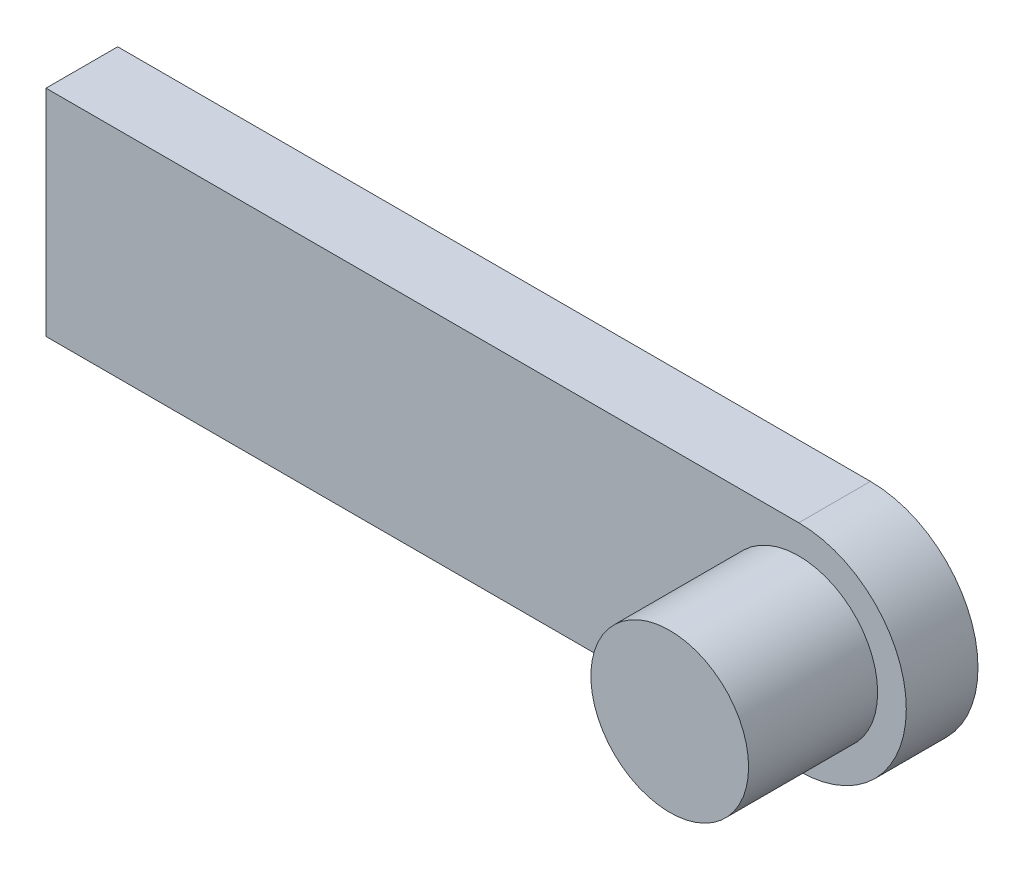
ISO-10303-21;
HEADER;
FILE_DESCRIPTION(('STEP AP214'),'2;1');
FILE_NAME('part.step','',(''),(''),'','','');
FILE_SCHEMA(('AUTOMOTIVE_DESIGN { 1 0 10303 214 1 1 1 1 }'));
ENDSEC;
DATA;
#1=APPLICATION_CONTEXT('core data for automotive mechanical design processes');
#2=APPLICATION_PROTOCOL_DEFINITION('international standard','automotive_design',2000,#1);
#3=PRODUCT_CONTEXT('',#1,'mechanical');
#4=PRODUCT('Part','Part','',(#3));
#5=PRODUCT_RELATED_PRODUCT_CATEGORY('part','',(#4));
#6=PRODUCT_DEFINITION_FORMATION('','',#4);
#7=PRODUCT_DEFINITION_CONTEXT('part definition',#1,'design');
#8=PRODUCT_DEFINITION('design','',#6,#7);
#9=PRODUCT_DEFINITION_SHAPE('','',#8);
#10=(LENGTH_UNIT() NAMED_UNIT(*) SI_UNIT(.MILLI.,.METRE.));
#11=(NAMED_UNIT(*) PLANE_ANGLE_UNIT() SI_UNIT($,.RADIAN.));
#12=(NAMED_UNIT(*) SI_UNIT($,.STERADIAN.) SOLID_ANGLE_UNIT());
#13=UNCERTAINTY_MEASURE_WITH_UNIT(LENGTH_MEASURE(1.E-05),#10,'distance_accuracy_value','');
#14=(GEOMETRIC_REPRESENTATION_CONTEXT(3) GLOBAL_UNCERTAINTY_ASSIGNED_CONTEXT((#13)) GLOBAL_UNIT_ASSIGNED_CONTEXT((#10,
#11,#12)) REPRESENTATION_CONTEXT('',''));
#15=CARTESIAN_POINT('',(0.,0.,0.));
#16=DIRECTION('',(0.,0.,1.));
#17=DIRECTION('',(1.,0.,0.));
#18=AXIS2_PLACEMENT_3D('',#15,#16,#17);
#19=CARTESIAN_POINT('',(0.,0.,0.25));
#20=DIRECTION('',(0.,0.,1.));
#21=DIRECTION('',(0.707106781186548,0.707106781186548,0.));
#22=AXIS2_PLACEMENT_3D('',#19,#20,#21);
#23=PLANE('',#22);
#24=DIRECTION('',(-1.,0.,0.));
#25=VECTOR('',#24,1.);
#26=CARTESIAN_POINT('',(1.275,0.375,0.25));
#27=LINE('',#26,#25);
#28=CARTESIAN_POINT('',(1.275,0.375,0.25));
#29=VERTEX_POINT('',#28);
#30=CARTESIAN_POINT('',(-1.35,0.375,0.25));
#31=VERTEX_POINT('',#30);
#32=EDGE_CURVE('E11',#29,#31,#27,.T.);
#33=ORIENTED_EDGE('',*,*,#32,.T.);
#34=DIRECTION('',(0.,-1.,0.));
#35=VECTOR('',#34,1.);
#36=CARTESIAN_POINT('',(-1.35,0.375,0.25));
#37=LINE('',#36,#35);
#38=CARTESIAN_POINT('',(-1.35,-0.375,0.25));
#39=VERTEX_POINT('',#38);
#40=EDGE_CURVE('E26',#31,#39,#37,.T.);
#41=ORIENTED_EDGE('',*,*,#40,.T.);
#42=DIRECTION('',(1.,0.,0.));
#43=VECTOR('',#42,1.);
#44=CARTESIAN_POINT('',(-1.35,-0.375,0.25));
#45=LINE('',#44,#43);
#46=CARTESIAN_POINT('',(1.275,-0.375,0.25));
#47=VERTEX_POINT('',#46);
#48=EDGE_CURVE('E100',#39,#47,#45,.T.);
#49=ORIENTED_EDGE('',*,*,#48,.T.);
#50=CARTESIAN_POINT('',(1.275,0.,0.25));
#51=DIRECTION('',(0.,0.,1.));
#52=DIRECTION('',(0.,-1.,0.));
#53=AXIS2_PLACEMENT_3D('',#50,#51,#52);
#54=CIRCLE('',#53,0.375);
#55=EDGE_CURVE('E68',#47,#29,#54,.T.);
#56=ORIENTED_EDGE('',*,*,#55,.T.);
#57=EDGE_LOOP('',(#33,#41,#49,#56));
#58=FACE_BOUND('',#57,.T.);
#59=CARTESIAN_POINT('',(1.275,0.,0.25));
#60=DIRECTION('',(0.,0.,1.));
#61=DIRECTION('',(1.,0.,0.));
#62=AXIS2_PLACEMENT_3D('',#59,#60,#61);
#63=CIRCLE('',#62,0.275);
#64=CARTESIAN_POINT('',(1.55,0.,0.25));
#65=VERTEX_POINT('',#64);
#66=EDGE_CURVE('E95',#65,#65,#63,.T.);
#67=ORIENTED_EDGE('',*,*,#66,.F.);
#68=EDGE_LOOP('',(#67));
#69=FACE_BOUND('',#68,.T.);
#70=ADVANCED_FACE('F16',(#58,#69),#23,.T.);
#71=CARTESIAN_POINT('',(1.275,0.,0.25));
#72=DIRECTION('',(0.,0.,1.));
#73=DIRECTION('',(1.,0.,0.));
#74=AXIS2_PLACEMENT_3D('',#71,#72,#73);
#75=CYLINDRICAL_SURFACE('',#74,0.275);
#76=CARTESIAN_POINT('',(1.275,0.,0.7));
#77=DIRECTION('',(0.,0.,1.));
#78=DIRECTION('',(1.,0.,0.));
#79=AXIS2_PLACEMENT_3D('',#76,#77,#78);
#80=CIRCLE('',#79,0.275);
#81=CARTESIAN_POINT('',(1.55,0.,0.7));
#82=VERTEX_POINT('',#81);
#83=EDGE_CURVE('E80',#82,#82,#80,.T.);
#84=ORIENTED_EDGE('',*,*,#83,.F.);
#85=EDGE_LOOP('',(#84));
#86=FACE_BOUND('',#85,.T.);
#87=ORIENTED_EDGE('',*,*,#66,.T.);
#88=EDGE_LOOP('',(#87));
#89=FACE_BOUND('',#88,.T.);
#90=ADVANCED_FACE('F105',(#86,#89),#75,.T.);
#91=CARTESIAN_POINT('',(1.275,0.375,0.));
#92=DIRECTION('',(0.,1.,0.));
#93=DIRECTION('',(0.707106781186548,0.,0.707106781186548));
#94=AXIS2_PLACEMENT_3D('',#91,#92,#93);
#95=PLANE('',#94);
#96=DIRECTION('',(-1.,0.,0.));
#97=VECTOR('',#96,1.);
#98=CARTESIAN_POINT('',(1.275,0.375,0.));
#99=LINE('',#98,#97);
#100=CARTESIAN_POINT('',(1.275,0.375,0.));
#101=VERTEX_POINT('',#100);
#102=CARTESIAN_POINT('',(-1.35,0.375,0.));
#103=VERTEX_POINT('',#102);
#104=EDGE_CURVE('E78',#101,#103,#99,.T.);
#105=ORIENTED_EDGE('',*,*,#104,.T.);
#106=DIRECTION('',(0.,0.,1.));
#107=VECTOR('',#106,1.);
#108=CARTESIAN_POINT('',(-1.35,0.375,0.));
#109=LINE('',#108,#107);
#110=EDGE_CURVE('E86',#103,#31,#109,.T.);
#111=ORIENTED_EDGE('',*,*,#110,.T.);
#112=ORIENTED_EDGE('',*,*,#32,.F.);
#113=DIRECTION('',(0.,0.,1.));
#114=VECTOR('',#113,1.);
#115=CARTESIAN_POINT('',(1.275,0.375,0.));
#116=LINE('',#115,#114);
#117=EDGE_CURVE('E79',#101,#29,#116,.T.);
#118=ORIENTED_EDGE('',*,*,#117,.F.);
#119=EDGE_LOOP('',(#105,#111,#112,#118));
#120=FACE_BOUND('',#119,.T.);
#121=ADVANCED_FACE('F94',(#120),#95,.T.);
#122=CARTESIAN_POINT('',(-1.35,0.375,0.));
#123=DIRECTION('',(-1.,0.,0.));
#124=DIRECTION('',(0.,0.707106781186548,0.707106781186548));
#125=AXIS2_PLACEMENT_3D('',#122,#123,#124);
#126=PLANE('',#125);
#127=DIRECTION('',(0.,-1.,0.));
#128=VECTOR('',#127,1.);
#129=CARTESIAN_POINT('',(-1.35,0.375,0.));
#130=LINE('',#129,#128);
#131=CARTESIAN_POINT('',(-1.35,-0.375,0.));
#132=VERTEX_POINT('',#131);
#133=EDGE_CURVE('E88',#103,#132,#130,.T.);
#134=ORIENTED_EDGE('',*,*,#133,.T.);
#135=DIRECTION('',(0.,0.,1.));
#136=VECTOR('',#135,1.);
#137=CARTESIAN_POINT('',(-1.35,-0.375,0.));
#138=LINE('',#137,#136);
#139=EDGE_CURVE('E57',#132,#39,#138,.T.);
#140=ORIENTED_EDGE('',*,*,#139,.T.);
#141=ORIENTED_EDGE('',*,*,#40,.F.);
#142=ORIENTED_EDGE('',*,*,#110,.F.);
#143=EDGE_LOOP('',(#134,#140,#141,#142));
#144=FACE_BOUND('',#143,.T.);
#145=ADVANCED_FACE('F90',(#144),#126,.T.);
#146=CARTESIAN_POINT('',(-1.35,-0.375,0.));
#147=DIRECTION('',(0.,-1.,0.));
#148=DIRECTION('',(0.707106781186548,0.,0.707106781186548));
#149=AXIS2_PLACEMENT_3D('',#146,#147,#148);
#150=PLANE('',#149);
#151=DIRECTION('',(1.,0.,0.));
#152=VECTOR('',#151,1.);
#153=CARTESIAN_POINT('',(-1.35,-0.375,0.));
#154=LINE('',#153,#152);
#155=CARTESIAN_POINT('',(1.275,-0.375,0.));
#156=VERTEX_POINT('',#155);
#157=EDGE_CURVE('E70',#132,#156,#154,.T.);
#158=ORIENTED_EDGE('',*,*,#157,.T.);
#159=DIRECTION('',(0.,0.,1.));
#160=VECTOR('',#159,1.);
#161=CARTESIAN_POINT('',(1.275,-0.375,0.));
#162=LINE('',#161,#160);
#163=EDGE_CURVE('E63',#156,#47,#162,.T.);
#164=ORIENTED_EDGE('',*,*,#163,.T.);
#165=ORIENTED_EDGE('',*,*,#48,.F.);
#166=ORIENTED_EDGE('',*,*,#139,.F.);
#167=EDGE_LOOP('',(#158,#164,#165,#166));
#168=FACE_BOUND('',#167,.T.);
#169=ADVANCED_FACE('F72',(#168),#150,.T.);
#170=CARTESIAN_POINT('',(1.275,0.,0.));
#171=DIRECTION('',(0.,0.,1.));
#172=DIRECTION('',(0.,-1.,0.));
#173=AXIS2_PLACEMENT_3D('',#170,#171,#172);
#174=CYLINDRICAL_SURFACE('',#173,0.375);
#175=CARTESIAN_POINT('',(1.275,0.,0.));
#176=DIRECTION('',(0.,0.,1.));
#177=DIRECTION('',(0.,-1.,0.));
#178=AXIS2_PLACEMENT_3D('',#175,#176,#177);
#179=CIRCLE('',#178,0.375);
#180=EDGE_CURVE('E20',#156,#101,#179,.T.);
#181=ORIENTED_EDGE('',*,*,#180,.T.);
#182=ORIENTED_EDGE('',*,*,#117,.T.);
#183=ORIENTED_EDGE('',*,*,#55,.F.);
#184=ORIENTED_EDGE('',*,*,#163,.F.);
#185=EDGE_LOOP('',(#181,#182,#183,#184));
#186=FACE_BOUND('',#185,.T.);
#187=ADVANCED_FACE('F64',(#186),#174,.T.);
#188=CARTESIAN_POINT('',(2.55,0.,0.7));
#189=DIRECTION('',(0.,0.,-1.));
#190=DIRECTION('',(0.707106781186548,0.707106781186548,0.));
#191=AXIS2_PLACEMENT_3D('',#188,#189,#190);
#192=PLANE('',#191);
#193=ORIENTED_EDGE('',*,*,#83,.T.);
#194=EDGE_LOOP('',(#193));
#195=FACE_BOUND('',#194,.T.);
#196=ADVANCED_FACE('F122',(#195),#192,.F.);
#197=CARTESIAN_POINT('',(0.,0.,0.));
#198=DIRECTION('',(0.,0.,1.));
#199=DIRECTION('',(0.707106781186548,0.707106781186548,0.));
#200=AXIS2_PLACEMENT_3D('',#197,#198,#199);
#201=PLANE('',#200);
#202=ORIENTED_EDGE('',*,*,#180,.F.);
#203=ORIENTED_EDGE('',*,*,#157,.F.);
#204=ORIENTED_EDGE('',*,*,#133,.F.);
#205=ORIENTED_EDGE('',*,*,#104,.F.);
#206=EDGE_LOOP('',(#202,#203,#204,#205));
#207=FACE_BOUND('',#206,.T.);
#208=ADVANCED_FACE('F18',(#207),#201,.F.);
#209=CLOSED_SHELL('',(#70,#90,#121,#145,#169,#187,#196,#208));
#210=MANIFOLD_SOLID_BREP('B1',#209);
#211=ADVANCED_BREP_SHAPE_REPRESENTATION('',(#18,#210),#14);
#212=SHAPE_DEFINITION_REPRESENTATION(#9,#211);
ENDSEC;
END-ISO-10303-21;
